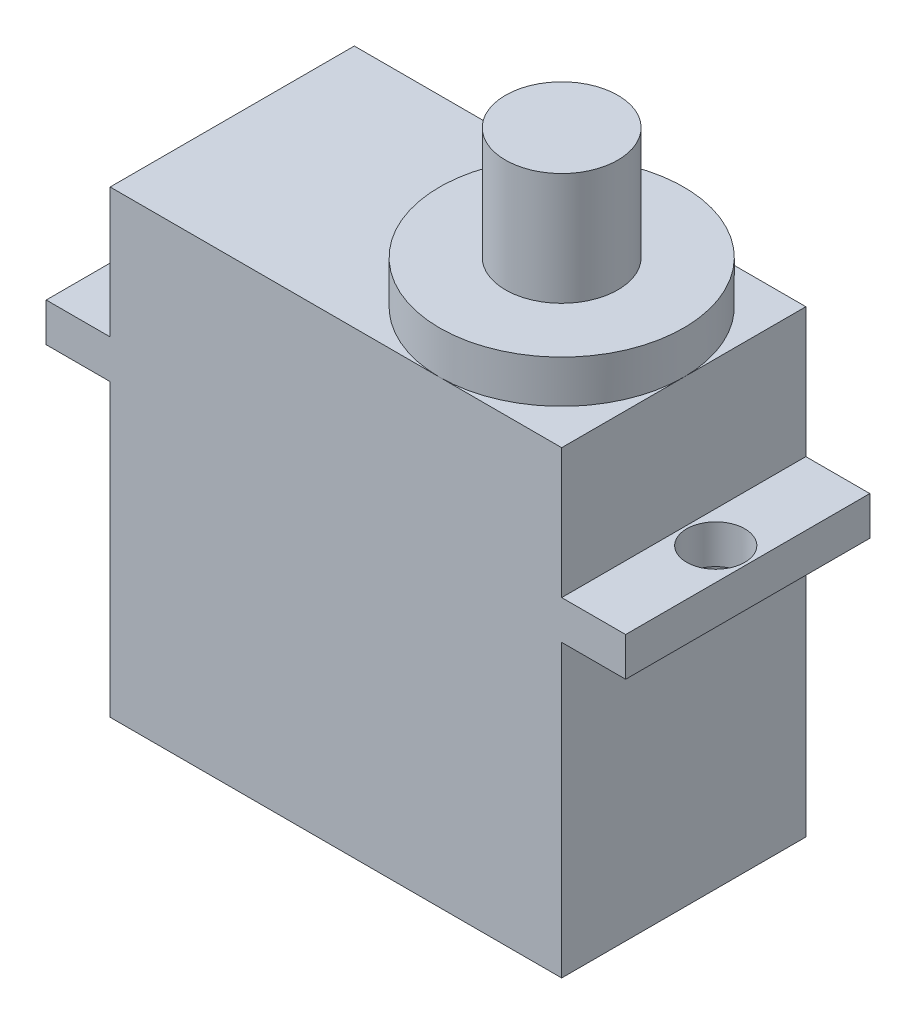
ISO-10303-21;
HEADER;
FILE_DESCRIPTION(('STEP AP214'),'2;1');
FILE_NAME('part.step','',(''),(''),'','','');
FILE_SCHEMA(('AUTOMOTIVE_DESIGN { 1 0 10303 214 1 1 1 1 }'));
ENDSEC;
DATA;
#1=APPLICATION_CONTEXT('core data for automotive mechanical design processes');
#2=APPLICATION_PROTOCOL_DEFINITION('international standard','automotive_design',2000,#1);
#3=PRODUCT_CONTEXT('',#1,'mechanical');
#4=PRODUCT('Part','Part','',(#3));
#5=PRODUCT_RELATED_PRODUCT_CATEGORY('part','',(#4));
#6=PRODUCT_DEFINITION_FORMATION('','',#4);
#7=PRODUCT_DEFINITION_CONTEXT('part definition',#1,'design');
#8=PRODUCT_DEFINITION('design','',#6,#7);
#9=PRODUCT_DEFINITION_SHAPE('','',#8);
#10=(LENGTH_UNIT() NAMED_UNIT(*) SI_UNIT(.MILLI.,.METRE.));
#11=(NAMED_UNIT(*) PLANE_ANGLE_UNIT() SI_UNIT($,.RADIAN.));
#12=(NAMED_UNIT(*) SI_UNIT($,.STERADIAN.) SOLID_ANGLE_UNIT());
#13=UNCERTAINTY_MEASURE_WITH_UNIT(LENGTH_MEASURE(1.E-05),#10,'distance_accuracy_value','');
#14=(GEOMETRIC_REPRESENTATION_CONTEXT(3) GLOBAL_UNCERTAINTY_ASSIGNED_CONTEXT((#13)) GLOBAL_UNIT_ASSIGNED_CONTEXT((#10,
#11,#12)) REPRESENTATION_CONTEXT('',''));
#15=CARTESIAN_POINT('',(0.,0.,0.));
#16=DIRECTION('',(0.,0.,1.));
#17=DIRECTION('',(1.,0.,0.));
#18=AXIS2_PLACEMENT_3D('',#15,#16,#17);
#19=CARTESIAN_POINT('',(-11.65,11.85,6.3));
#20=DIRECTION('',(0.,-1.,0.));
#21=DIRECTION('',(0.,0.,-1.));
#22=AXIS2_PLACEMENT_3D('',#19,#20,#21);
#23=PLANE('',#22);
#24=CARTESIAN_POINT('',(5.34999999999999,11.85,0.));
#25=DIRECTION('',(0.,1.,0.));
#26=DIRECTION('',(0.,0.,1.));
#27=AXIS2_PLACEMENT_3D('',#24,#25,#26);
#28=CIRCLE('',#27,6.3);
#29=CARTESIAN_POINT('',(5.34999999999999,11.85,6.3));
#30=VERTEX_POINT('',#29);
#31=CARTESIAN_POINT('',(11.65,11.85,0.));
#32=VERTEX_POINT('',#31);
#33=EDGE_CURVE('E153',#30,#32,#28,.T.);
#34=ORIENTED_EDGE('',*,*,#33,.F.);
#35=DIRECTION('',(-1.,0.,0.));
#36=VECTOR('',#35,1.);
#37=CARTESIAN_POINT('',(-11.65,11.85,6.3));
#38=LINE('',#37,#36);
#39=CARTESIAN_POINT('',(11.65,11.85,6.3));
#40=VERTEX_POINT('',#39);
#41=EDGE_CURVE('E136',#40,#30,#38,.T.);
#42=ORIENTED_EDGE('',*,*,#41,.F.);
#43=DIRECTION('',(0.,0.,-1.));
#44=VECTOR('',#43,1.);
#45=CARTESIAN_POINT('',(11.65,11.85,6.3));
#46=LINE('',#45,#44);
#47=EDGE_CURVE('E154',#40,#32,#46,.T.);
#48=ORIENTED_EDGE('',*,*,#47,.T.);
#49=EDGE_LOOP('',(#34,#42,#48));
#50=FACE_BOUND('',#49,.T.);
#51=ADVANCED_FACE('F36',(#50),#23,.F.);
#52=CARTESIAN_POINT('',(5.34999999999999,11.85,-6.3));
#53=VERTEX_POINT('',#52);
#54=EDGE_CURVE('E45',#32,#53,#28,.T.);
#55=ORIENTED_EDGE('',*,*,#54,.F.);
#56=CARTESIAN_POINT('',(11.65,11.85,-6.3));
#57=VERTEX_POINT('',#56);
#58=EDGE_CURVE('E160',#32,#57,#46,.T.);
#59=ORIENTED_EDGE('',*,*,#58,.T.);
#60=DIRECTION('',(-1.,0.,0.));
#61=VECTOR('',#60,1.);
#62=CARTESIAN_POINT('',(-11.65,11.85,-6.3));
#63=LINE('',#62,#61);
#64=EDGE_CURVE('E189',#57,#53,#63,.T.);
#65=ORIENTED_EDGE('',*,*,#64,.T.);
#66=EDGE_LOOP('',(#55,#59,#65));
#67=FACE_BOUND('',#66,.T.);
#68=ADVANCED_FACE('F242',(#67),#23,.F.);
#69=CARTESIAN_POINT('',(11.65,5.15,6.3));
#70=DIRECTION('',(-1.,0.,0.));
#71=DIRECTION('',(0.,-1.,0.));
#72=AXIS2_PLACEMENT_3D('',#69,#70,#71);
#73=PLANE('',#72);
#74=DIRECTION('',(0.,1.,0.));
#75=VECTOR('',#74,1.);
#76=CARTESIAN_POINT('',(11.65,5.15,-6.3));
#77=LINE('',#76,#75);
#78=CARTESIAN_POINT('',(11.65,5.15,-6.3));
#79=VERTEX_POINT('',#78);
#80=EDGE_CURVE('E185',#79,#57,#77,.T.);
#81=ORIENTED_EDGE('',*,*,#80,.T.);
#82=ORIENTED_EDGE('',*,*,#58,.F.);
#83=ORIENTED_EDGE('',*,*,#47,.F.);
#84=DIRECTION('',(0.,1.,0.));
#85=VECTOR('',#84,1.);
#86=CARTESIAN_POINT('',(11.65,5.15,6.3));
#87=LINE('',#86,#85);
#88=CARTESIAN_POINT('',(11.65,5.15,6.3));
#89=VERTEX_POINT('',#88);
#90=EDGE_CURVE('E141',#89,#40,#87,.T.);
#91=ORIENTED_EDGE('',*,*,#90,.F.);
#92=DIRECTION('',(0.,0.,-1.));
#93=VECTOR('',#92,1.);
#94=CARTESIAN_POINT('',(11.65,5.15,6.3));
#95=LINE('',#94,#93);
#96=EDGE_CURVE('E184',#89,#79,#95,.T.);
#97=ORIENTED_EDGE('',*,*,#96,.T.);
#98=EDGE_LOOP('',(#81,#82,#83,#91,#97));
#99=FACE_BOUND('',#98,.T.);
#100=ADVANCED_FACE('F38',(#99),#73,.F.);
#101=EDGE_CURVE('E60',#53,#30,#28,.T.);
#102=ORIENTED_EDGE('',*,*,#101,.F.);
#103=CARTESIAN_POINT('',(-11.65,11.85,-6.3));
#104=VERTEX_POINT('',#103);
#105=EDGE_CURVE('E188',#53,#104,#63,.T.);
#106=ORIENTED_EDGE('',*,*,#105,.T.);
#107=DIRECTION('',(0.,0.,-1.));
#108=VECTOR('',#107,1.);
#109=CARTESIAN_POINT('',(-11.65,11.85,6.3));
#110=LINE('',#109,#108);
#111=CARTESIAN_POINT('',(-11.65,11.85,6.3));
#112=VERTEX_POINT('',#111);
#113=EDGE_CURVE('E150',#112,#104,#110,.T.);
#114=ORIENTED_EDGE('',*,*,#113,.F.);
#115=EDGE_CURVE('E138',#30,#112,#38,.T.);
#116=ORIENTED_EDGE('',*,*,#115,.F.);
#117=EDGE_LOOP('',(#102,#106,#114,#116));
#118=FACE_BOUND('',#117,.T.);
#119=ADVANCED_FACE('F148',(#118),#23,.F.);
#120=CARTESIAN_POINT('',(-11.65,5.15,6.3));
#121=DIRECTION('',(1.,0.,0.));
#122=DIRECTION('',(0.,1.,0.));
#123=AXIS2_PLACEMENT_3D('',#120,#121,#122);
#124=PLANE('',#123);
#125=DIRECTION('',(0.,-1.,0.));
#126=VECTOR('',#125,1.);
#127=CARTESIAN_POINT('',(-11.65,5.15,-6.3));
#128=LINE('',#127,#126);
#129=CARTESIAN_POINT('',(-11.65,5.15,-6.3));
#130=VERTEX_POINT('',#129);
#131=EDGE_CURVE('E191',#104,#130,#128,.T.);
#132=ORIENTED_EDGE('',*,*,#131,.T.);
#133=DIRECTION('',(0.,0.,-1.));
#134=VECTOR('',#133,1.);
#135=CARTESIAN_POINT('',(-11.65,5.15,6.3));
#136=LINE('',#135,#134);
#137=CARTESIAN_POINT('',(-11.65,5.15,6.3));
#138=VERTEX_POINT('',#137);
#139=EDGE_CURVE('E236',#138,#130,#136,.T.);
#140=ORIENTED_EDGE('',*,*,#139,.F.);
#141=DIRECTION('',(0.,-1.,0.));
#142=VECTOR('',#141,1.);
#143=CARTESIAN_POINT('',(-11.65,5.15,6.3));
#144=LINE('',#143,#142);
#145=EDGE_CURVE('E146',#112,#138,#144,.T.);
#146=ORIENTED_EDGE('',*,*,#145,.F.);
#147=ORIENTED_EDGE('',*,*,#113,.T.);
#148=EDGE_LOOP('',(#132,#140,#146,#147));
#149=FACE_BOUND('',#148,.T.);
#150=ADVANCED_FACE('F293',(#149),#124,.F.);
#151=CARTESIAN_POINT('',(-11.65,5.15,6.3));
#152=DIRECTION('',(0.,-1.,0.));
#153=DIRECTION('',(0.,0.,-1.));
#154=AXIS2_PLACEMENT_3D('',#151,#152,#153);
#155=PLANE('',#154);
#156=CARTESIAN_POINT('',(-13.3,5.15,0.));
#157=DIRECTION('',(0.,1.,0.));
#158=DIRECTION('',(0.,0.,1.));
#159=AXIS2_PLACEMENT_3D('',#156,#157,#158);
#160=CIRCLE('',#159,1.5);
#161=CARTESIAN_POINT('',(-13.3,5.15,1.5));
#162=VERTEX_POINT('',#161);
#163=EDGE_CURVE('E482',#162,#162,#160,.T.);
#164=ORIENTED_EDGE('',*,*,#163,.F.);
#165=EDGE_LOOP('',(#164));
#166=FACE_BOUND('',#165,.T.);
#167=DIRECTION('',(-1.,0.,0.));
#168=VECTOR('',#167,1.);
#169=CARTESIAN_POINT('',(-11.65,5.15,-6.3));
#170=LINE('',#169,#168);
#171=CARTESIAN_POINT('',(-14.95,5.15,-6.3));
#172=VERTEX_POINT('',#171);
#173=EDGE_CURVE('E193',#130,#172,#170,.T.);
#174=ORIENTED_EDGE('',*,*,#173,.T.);
#175=DIRECTION('',(0.,0.,-1.));
#176=VECTOR('',#175,1.);
#177=CARTESIAN_POINT('',(-14.95,5.15,6.3));
#178=LINE('',#177,#176);
#179=CARTESIAN_POINT('',(-14.95,5.15,6.3));
#180=VERTEX_POINT('',#179);
#181=EDGE_CURVE('E233',#180,#172,#178,.T.);
#182=ORIENTED_EDGE('',*,*,#181,.F.);
#183=DIRECTION('',(-1.,0.,0.));
#184=VECTOR('',#183,1.);
#185=CARTESIAN_POINT('',(-11.65,5.15,6.3));
#186=LINE('',#185,#184);
#187=EDGE_CURVE('E166',#138,#180,#186,.T.);
#188=ORIENTED_EDGE('',*,*,#187,.F.);
#189=ORIENTED_EDGE('',*,*,#139,.T.);
#190=EDGE_LOOP('',(#174,#182,#188,#189));
#191=FACE_BOUND('',#190,.T.);
#192=ADVANCED_FACE('F291',(#166,#191),#155,.F.);
#193=CARTESIAN_POINT('',(-14.95,5.15,6.3));
#194=DIRECTION('',(1.,0.,0.));
#195=DIRECTION('',(0.,0.,-1.));
#196=AXIS2_PLACEMENT_3D('',#193,#194,#195);
#197=PLANE('',#196);
#198=DIRECTION('',(0.,-1.,0.));
#199=VECTOR('',#198,1.);
#200=CARTESIAN_POINT('',(-14.95,5.15,-6.3));
#201=LINE('',#200,#199);
#202=CARTESIAN_POINT('',(-14.95,3.15,-6.3));
#203=VERTEX_POINT('',#202);
#204=EDGE_CURVE('E195',#172,#203,#201,.T.);
#205=ORIENTED_EDGE('',*,*,#204,.T.);
#206=DIRECTION('',(0.,0.,-1.));
#207=VECTOR('',#206,1.);
#208=CARTESIAN_POINT('',(-14.95,3.15,6.3));
#209=LINE('',#208,#207);
#210=CARTESIAN_POINT('',(-14.95,3.15,6.3));
#211=VERTEX_POINT('',#210);
#212=EDGE_CURVE('E230',#211,#203,#209,.T.);
#213=ORIENTED_EDGE('',*,*,#212,.F.);
#214=DIRECTION('',(0.,-1.,0.));
#215=VECTOR('',#214,1.);
#216=CARTESIAN_POINT('',(-14.95,5.15,6.3));
#217=LINE('',#216,#215);
#218=EDGE_CURVE('E168',#180,#211,#217,.T.);
#219=ORIENTED_EDGE('',*,*,#218,.F.);
#220=ORIENTED_EDGE('',*,*,#181,.T.);
#221=EDGE_LOOP('',(#205,#213,#219,#220));
#222=FACE_BOUND('',#221,.T.);
#223=ADVANCED_FACE('F286',(#222),#197,.F.);
#224=CARTESIAN_POINT('',(-14.95,3.15,6.3));
#225=DIRECTION('',(0.,1.,0.));
#226=DIRECTION('',(-1.,0.,0.));
#227=AXIS2_PLACEMENT_3D('',#224,#225,#226);
#228=PLANE('',#227);
#229=CARTESIAN_POINT('',(-13.3,3.15,0.));
#230=DIRECTION('',(0.,1.,0.));
#231=DIRECTION('',(-1.,0.,0.));
#232=AXIS2_PLACEMENT_3D('',#229,#230,#231);
#233=CIRCLE('',#232,1.5);
#234=CARTESIAN_POINT('',(-14.8,3.15,0.));
#235=VERTEX_POINT('',#234);
#236=EDGE_CURVE('E40',#235,#235,#233,.T.);
#237=ORIENTED_EDGE('',*,*,#236,.T.);
#238=EDGE_LOOP('',(#237));
#239=FACE_BOUND('',#238,.T.);
#240=DIRECTION('',(1.,0.,0.));
#241=VECTOR('',#240,1.);
#242=CARTESIAN_POINT('',(-14.95,3.15,-6.3));
#243=LINE('',#242,#241);
#244=CARTESIAN_POINT('',(-11.65,3.15,-6.3));
#245=VERTEX_POINT('',#244);
#246=EDGE_CURVE('E197',#203,#245,#243,.T.);
#247=ORIENTED_EDGE('',*,*,#246,.T.);
#248=DIRECTION('',(0.,0.,-1.));
#249=VECTOR('',#248,1.);
#250=CARTESIAN_POINT('',(-11.65,3.15,6.3));
#251=LINE('',#250,#249);
#252=CARTESIAN_POINT('',(-11.65,3.15,6.3));
#253=VERTEX_POINT('',#252);
#254=EDGE_CURVE('E227',#253,#245,#251,.T.);
#255=ORIENTED_EDGE('',*,*,#254,.F.);
#256=DIRECTION('',(1.,0.,0.));
#257=VECTOR('',#256,1.);
#258=CARTESIAN_POINT('',(-14.95,3.15,6.3));
#259=LINE('',#258,#257);
#260=EDGE_CURVE('E170',#211,#253,#259,.T.);
#261=ORIENTED_EDGE('',*,*,#260,.F.);
#262=ORIENTED_EDGE('',*,*,#212,.T.);
#263=EDGE_LOOP('',(#247,#255,#261,#262));
#264=FACE_BOUND('',#263,.T.);
#265=ADVANCED_FACE('F281',(#239,#264),#228,.F.);
#266=CARTESIAN_POINT('',(-11.65,-11.85,6.3));
#267=DIRECTION('',(1.,0.,0.));
#268=DIRECTION('',(0.,1.,0.));
#269=AXIS2_PLACEMENT_3D('',#266,#267,#268);
#270=PLANE('',#269);
#271=DIRECTION('',(0.,-1.,0.));
#272=VECTOR('',#271,1.);
#273=CARTESIAN_POINT('',(-11.65,-11.85,-6.3));
#274=LINE('',#273,#272);
#275=CARTESIAN_POINT('',(-11.65,-11.85,-6.3));
#276=VERTEX_POINT('',#275);
#277=EDGE_CURVE('E199',#245,#276,#274,.T.);
#278=ORIENTED_EDGE('',*,*,#277,.T.);
#279=DIRECTION('',(0.,0.,-1.));
#280=VECTOR('',#279,1.);
#281=CARTESIAN_POINT('',(-11.65,-11.85,6.3));
#282=LINE('',#281,#280);
#283=CARTESIAN_POINT('',(-11.65,-11.85,6.3));
#284=VERTEX_POINT('',#283);
#285=EDGE_CURVE('E224',#284,#276,#282,.T.);
#286=ORIENTED_EDGE('',*,*,#285,.F.);
#287=DIRECTION('',(0.,-1.,0.));
#288=VECTOR('',#287,1.);
#289=CARTESIAN_POINT('',(-11.65,-11.85,6.3));
#290=LINE('',#289,#288);
#291=EDGE_CURVE('E172',#253,#284,#290,.T.);
#292=ORIENTED_EDGE('',*,*,#291,.F.);
#293=ORIENTED_EDGE('',*,*,#254,.T.);
#294=EDGE_LOOP('',(#278,#286,#292,#293));
#295=FACE_BOUND('',#294,.T.);
#296=ADVANCED_FACE('F277',(#295),#270,.F.);
#297=CARTESIAN_POINT('',(-11.65,-11.85,6.3));
#298=DIRECTION('',(0.,1.,0.));
#299=DIRECTION('',(0.,0.,1.));
#300=AXIS2_PLACEMENT_3D('',#297,#298,#299);
#301=PLANE('',#300);
#302=DIRECTION('',(1.,0.,0.));
#303=VECTOR('',#302,1.);
#304=CARTESIAN_POINT('',(-11.65,-11.85,-6.3));
#305=LINE('',#304,#303);
#306=CARTESIAN_POINT('',(11.65,-11.85,-6.3));
#307=VERTEX_POINT('',#306);
#308=EDGE_CURVE('E201',#276,#307,#305,.T.);
#309=ORIENTED_EDGE('',*,*,#308,.T.);
#310=DIRECTION('',(0.,0.,-1.));
#311=VECTOR('',#310,1.);
#312=CARTESIAN_POINT('',(11.65,-11.85,6.3));
#313=LINE('',#312,#311);
#314=CARTESIAN_POINT('',(11.65,-11.85,6.3));
#315=VERTEX_POINT('',#314);
#316=EDGE_CURVE('E221',#315,#307,#313,.T.);
#317=ORIENTED_EDGE('',*,*,#316,.F.);
#318=DIRECTION('',(1.,0.,0.));
#319=VECTOR('',#318,1.);
#320=CARTESIAN_POINT('',(-11.65,-11.85,6.3));
#321=LINE('',#320,#319);
#322=EDGE_CURVE('E174',#284,#315,#321,.T.);
#323=ORIENTED_EDGE('',*,*,#322,.F.);
#324=ORIENTED_EDGE('',*,*,#285,.T.);
#325=EDGE_LOOP('',(#309,#317,#323,#324));
#326=FACE_BOUND('',#325,.T.);
#327=ADVANCED_FACE('F272',(#326),#301,.F.);
#328=CARTESIAN_POINT('',(11.65,-11.85,6.3));
#329=DIRECTION('',(-1.,0.,0.));
#330=DIRECTION('',(0.,0.,1.));
#331=AXIS2_PLACEMENT_3D('',#328,#329,#330);
#332=PLANE('',#331);
#333=DIRECTION('',(0.,1.,0.));
#334=VECTOR('',#333,1.);
#335=CARTESIAN_POINT('',(11.65,-11.85,-6.3));
#336=LINE('',#335,#334);
#337=CARTESIAN_POINT('',(11.65,3.15,-6.3));
#338=VERTEX_POINT('',#337);
#339=EDGE_CURVE('E203',#307,#338,#336,.T.);
#340=ORIENTED_EDGE('',*,*,#339,.T.);
#341=DIRECTION('',(0.,0.,-1.));
#342=VECTOR('',#341,1.);
#343=CARTESIAN_POINT('',(11.65,3.15,6.3));
#344=LINE('',#343,#342);
#345=CARTESIAN_POINT('',(11.65,3.15,6.3));
#346=VERTEX_POINT('',#345);
#347=EDGE_CURVE('E218',#346,#338,#344,.T.);
#348=ORIENTED_EDGE('',*,*,#347,.F.);
#349=DIRECTION('',(0.,1.,0.));
#350=VECTOR('',#349,1.);
#351=CARTESIAN_POINT('',(11.65,-11.85,6.3));
#352=LINE('',#351,#350);
#353=EDGE_CURVE('E176',#315,#346,#352,.T.);
#354=ORIENTED_EDGE('',*,*,#353,.F.);
#355=ORIENTED_EDGE('',*,*,#316,.T.);
#356=EDGE_LOOP('',(#340,#348,#354,#355));
#357=FACE_BOUND('',#356,.T.);
#358=ADVANCED_FACE('F266',(#357),#332,.F.);
#359=CARTESIAN_POINT('',(14.95,3.15,6.3));
#360=DIRECTION('',(0.,1.,0.));
#361=DIRECTION('',(-1.,0.,0.));
#362=AXIS2_PLACEMENT_3D('',#359,#360,#361);
#363=PLANE('',#362);
#364=CARTESIAN_POINT('',(13.3,3.15,0.));
#365=DIRECTION('',(0.,1.,0.));
#366=DIRECTION('',(-1.,0.,0.));
#367=AXIS2_PLACEMENT_3D('',#364,#365,#366);
#368=CIRCLE('',#367,1.5);
#369=CARTESIAN_POINT('',(11.8,3.15,0.));
#370=VERTEX_POINT('',#369);
#371=EDGE_CURVE('E485',#370,#370,#368,.T.);
#372=ORIENTED_EDGE('',*,*,#371,.T.);
#373=EDGE_LOOP('',(#372));
#374=FACE_BOUND('',#373,.T.);
#375=DIRECTION('',(1.,0.,0.));
#376=VECTOR('',#375,1.);
#377=CARTESIAN_POINT('',(14.95,3.15,-6.3));
#378=LINE('',#377,#376);
#379=CARTESIAN_POINT('',(14.95,3.15,-6.3));
#380=VERTEX_POINT('',#379);
#381=EDGE_CURVE('E205',#338,#380,#378,.T.);
#382=ORIENTED_EDGE('',*,*,#381,.T.);
#383=DIRECTION('',(0.,0.,-1.));
#384=VECTOR('',#383,1.);
#385=CARTESIAN_POINT('',(14.95,3.15,6.3));
#386=LINE('',#385,#384);
#387=CARTESIAN_POINT('',(14.95,3.15,6.3));
#388=VERTEX_POINT('',#387);
#389=EDGE_CURVE('E215',#388,#380,#386,.T.);
#390=ORIENTED_EDGE('',*,*,#389,.F.);
#391=DIRECTION('',(1.,0.,0.));
#392=VECTOR('',#391,1.);
#393=CARTESIAN_POINT('',(14.95,3.15,6.3));
#394=LINE('',#393,#392);
#395=EDGE_CURVE('E178',#346,#388,#394,.T.);
#396=ORIENTED_EDGE('',*,*,#395,.F.);
#397=ORIENTED_EDGE('',*,*,#347,.T.);
#398=EDGE_LOOP('',(#382,#390,#396,#397));
#399=FACE_BOUND('',#398,.T.);
#400=ADVANCED_FACE('F262',(#374,#399),#363,.F.);
#401=CARTESIAN_POINT('',(14.95,5.15,6.3));
#402=DIRECTION('',(-1.,0.,0.));
#403=DIRECTION('',(0.,0.,1.));
#404=AXIS2_PLACEMENT_3D('',#401,#402,#403);
#405=PLANE('',#404);
#406=DIRECTION('',(0.,1.,0.));
#407=VECTOR('',#406,1.);
#408=CARTESIAN_POINT('',(14.95,5.15,-6.3));
#409=LINE('',#408,#407);
#410=CARTESIAN_POINT('',(14.95,5.15,-6.3));
#411=VERTEX_POINT('',#410);
#412=EDGE_CURVE('E207',#380,#411,#409,.T.);
#413=ORIENTED_EDGE('',*,*,#412,.T.);
#414=DIRECTION('',(0.,0.,-1.));
#415=VECTOR('',#414,1.);
#416=CARTESIAN_POINT('',(14.95,5.15,6.3));
#417=LINE('',#416,#415);
#418=CARTESIAN_POINT('',(14.95,5.15,6.3));
#419=VERTEX_POINT('',#418);
#420=EDGE_CURVE('E212',#419,#411,#417,.T.);
#421=ORIENTED_EDGE('',*,*,#420,.F.);
#422=DIRECTION('',(0.,1.,0.));
#423=VECTOR('',#422,1.);
#424=CARTESIAN_POINT('',(14.95,5.15,6.3));
#425=LINE('',#424,#423);
#426=EDGE_CURVE('E180',#388,#419,#425,.T.);
#427=ORIENTED_EDGE('',*,*,#426,.F.);
#428=ORIENTED_EDGE('',*,*,#389,.T.);
#429=EDGE_LOOP('',(#413,#421,#427,#428));
#430=FACE_BOUND('',#429,.T.);
#431=ADVANCED_FACE('F257',(#430),#405,.F.);
#432=CARTESIAN_POINT('',(11.65,5.15,6.3));
#433=DIRECTION('',(0.,-1.,0.));
#434=DIRECTION('',(0.,0.,-1.));
#435=AXIS2_PLACEMENT_3D('',#432,#433,#434);
#436=PLANE('',#435);
#437=CARTESIAN_POINT('',(13.3,5.15,0.));
#438=DIRECTION('',(0.,1.,0.));
#439=DIRECTION('',(0.,0.,-1.));
#440=AXIS2_PLACEMENT_3D('',#437,#438,#439);
#441=CIRCLE('',#440,1.5);
#442=CARTESIAN_POINT('',(13.3,5.15,-1.5));
#443=VERTEX_POINT('',#442);
#444=EDGE_CURVE('E491',#443,#443,#441,.T.);
#445=ORIENTED_EDGE('',*,*,#444,.F.);
#446=EDGE_LOOP('',(#445));
#447=FACE_BOUND('',#446,.T.);
#448=DIRECTION('',(-1.,0.,0.));
#449=VECTOR('',#448,1.);
#450=CARTESIAN_POINT('',(11.65,5.15,-6.3));
#451=LINE('',#450,#449);
#452=EDGE_CURVE('E163',#411,#79,#451,.T.);
#453=ORIENTED_EDGE('',*,*,#452,.T.);
#454=ORIENTED_EDGE('',*,*,#96,.F.);
#455=DIRECTION('',(-1.,0.,0.));
#456=VECTOR('',#455,1.);
#457=CARTESIAN_POINT('',(11.65,5.15,6.3));
#458=LINE('',#457,#456);
#459=EDGE_CURVE('E182',#419,#89,#458,.T.);
#460=ORIENTED_EDGE('',*,*,#459,.F.);
#461=ORIENTED_EDGE('',*,*,#420,.T.);
#462=EDGE_LOOP('',(#453,#454,#460,#461));
#463=FACE_BOUND('',#462,.T.);
#464=ADVANCED_FACE('F251',(#447,#463),#436,.F.);
#465=CARTESIAN_POINT('',(0.,0.,6.3));
#466=DIRECTION('',(0.,0.,-1.));
#467=DIRECTION('',(-1.,0.,0.));
#468=AXIS2_PLACEMENT_3D('',#465,#466,#467);
#469=PLANE('',#468);
#470=ORIENTED_EDGE('',*,*,#90,.T.);
#471=ORIENTED_EDGE('',*,*,#41,.T.);
#472=ORIENTED_EDGE('',*,*,#115,.T.);
#473=ORIENTED_EDGE('',*,*,#145,.T.);
#474=ORIENTED_EDGE('',*,*,#187,.T.);
#475=ORIENTED_EDGE('',*,*,#218,.T.);
#476=ORIENTED_EDGE('',*,*,#260,.T.);
#477=ORIENTED_EDGE('',*,*,#291,.T.);
#478=ORIENTED_EDGE('',*,*,#322,.T.);
#479=ORIENTED_EDGE('',*,*,#353,.T.);
#480=ORIENTED_EDGE('',*,*,#395,.T.);
#481=ORIENTED_EDGE('',*,*,#426,.T.);
#482=ORIENTED_EDGE('',*,*,#459,.T.);
#483=EDGE_LOOP('',(#470,#471,#472,#473,#474,#475,#476,#477,#478,#479,#480,#481,#482));
#484=FACE_BOUND('',#483,.T.);
#485=ADVANCED_FACE('F137',(#484),#469,.F.);
#486=CARTESIAN_POINT('',(0.,0.,-6.3));
#487=DIRECTION('',(0.,0.,-1.));
#488=DIRECTION('',(-1.,0.,0.));
#489=AXIS2_PLACEMENT_3D('',#486,#487,#488);
#490=PLANE('',#489);
#491=ORIENTED_EDGE('',*,*,#80,.F.);
#492=ORIENTED_EDGE('',*,*,#452,.F.);
#493=ORIENTED_EDGE('',*,*,#412,.F.);
#494=ORIENTED_EDGE('',*,*,#381,.F.);
#495=ORIENTED_EDGE('',*,*,#339,.F.);
#496=ORIENTED_EDGE('',*,*,#308,.F.);
#497=ORIENTED_EDGE('',*,*,#277,.F.);
#498=ORIENTED_EDGE('',*,*,#246,.F.);
#499=ORIENTED_EDGE('',*,*,#204,.F.);
#500=ORIENTED_EDGE('',*,*,#173,.F.);
#501=ORIENTED_EDGE('',*,*,#131,.F.);
#502=ORIENTED_EDGE('',*,*,#105,.F.);
#503=ORIENTED_EDGE('',*,*,#64,.F.);
#504=EDGE_LOOP('',(#491,#492,#493,#494,#495,#496,#497,#498,#499,#500,#501,#502,#503));
#505=FACE_BOUND('',#504,.T.);
#506=ADVANCED_FACE('F246',(#505),#490,.T.);
#507=CARTESIAN_POINT('',(5.34999999999999,14.05,0.));
#508=DIRECTION('',(0.,-1.,0.));
#509=DIRECTION('',(0.,0.,-1.));
#510=AXIS2_PLACEMENT_3D('',#507,#508,#509);
#511=CYLINDRICAL_SURFACE('',#510,6.3);
#512=CARTESIAN_POINT('',(5.34999999999999,14.05,0.));
#513=DIRECTION('',(0.,1.,0.));
#514=DIRECTION('',(0.,0.,1.));
#515=AXIS2_PLACEMENT_3D('',#512,#513,#514);
#516=CIRCLE('',#515,6.3);
#517=CARTESIAN_POINT('',(5.34999999999999,14.05,6.3));
#518=VERTEX_POINT('',#517);
#519=EDGE_CURVE('E156',#518,#518,#516,.T.);
#520=ORIENTED_EDGE('',*,*,#519,.F.);
#521=EDGE_LOOP('',(#520));
#522=FACE_BOUND('',#521,.T.);
#523=ORIENTED_EDGE('',*,*,#33,.T.);
#524=ORIENTED_EDGE('',*,*,#54,.T.);
#525=ORIENTED_EDGE('',*,*,#101,.T.);
#526=EDGE_LOOP('',(#523,#524,#525));
#527=FACE_BOUND('',#526,.T.);
#528=ADVANCED_FACE('F159',(#522,#527),#511,.T.);
#529=CARTESIAN_POINT('',(0.,14.05,0.));
#530=DIRECTION('',(0.,1.,0.));
#531=DIRECTION('',(0.,0.,1.));
#532=AXIS2_PLACEMENT_3D('',#529,#530,#531);
#533=PLANE('',#532);
#534=CARTESIAN_POINT('',(5.34999999999999,14.05,0.));
#535=DIRECTION('',(0.,1.,0.));
#536=DIRECTION('',(-1.,0.,0.));
#537=AXIS2_PLACEMENT_3D('',#534,#535,#536);
#538=CIRCLE('',#537,2.9);
#539=CARTESIAN_POINT('',(2.44999999999999,14.05,0.));
#540=VERTEX_POINT('',#539);
#541=EDGE_CURVE('E11',#540,#540,#538,.T.);
#542=ORIENTED_EDGE('',*,*,#541,.F.);
#543=EDGE_LOOP('',(#542));
#544=FACE_BOUND('',#543,.T.);
#545=ORIENTED_EDGE('',*,*,#519,.T.);
#546=EDGE_LOOP('',(#545));
#547=FACE_BOUND('',#546,.T.);
#548=ADVANCED_FACE('F344',(#544,#547),#533,.T.);
#549=CARTESIAN_POINT('',(5.34999999999999,19.85,0.));
#550=DIRECTION('',(0.,-1.,0.));
#551=DIRECTION('',(0.,0.,-1.));
#552=AXIS2_PLACEMENT_3D('',#549,#550,#551);
#553=CYLINDRICAL_SURFACE('',#552,2.9);
#554=CARTESIAN_POINT('',(5.34999999999999,19.85,0.));
#555=DIRECTION('',(0.,1.,0.));
#556=DIRECTION('',(-1.,0.,0.));
#557=AXIS2_PLACEMENT_3D('',#554,#555,#556);
#558=CIRCLE('',#557,2.9);
#559=CARTESIAN_POINT('',(2.44999999999999,19.85,0.));
#560=VERTEX_POINT('',#559);
#561=EDGE_CURVE('E157',#560,#560,#558,.T.);
#562=ORIENTED_EDGE('',*,*,#561,.F.);
#563=EDGE_LOOP('',(#562));
#564=FACE_BOUND('',#563,.T.);
#565=ORIENTED_EDGE('',*,*,#541,.T.);
#566=EDGE_LOOP('',(#565));
#567=FACE_BOUND('',#566,.T.);
#568=ADVANCED_FACE('F355',(#564,#567),#553,.T.);
#569=CARTESIAN_POINT('',(5.34999999999999,19.85,0.));
#570=DIRECTION('',(0.,1.,0.));
#571=DIRECTION('',(-1.,0.,0.));
#572=AXIS2_PLACEMENT_3D('',#569,#570,#571);
#573=PLANE('',#572);
#574=ORIENTED_EDGE('',*,*,#561,.T.);
#575=EDGE_LOOP('',(#574));
#576=FACE_BOUND('',#575,.T.);
#577=ADVANCED_FACE('F365',(#576),#573,.T.);
#578=CARTESIAN_POINT('',(13.3,-0.649999999999998,0.));
#579=DIRECTION('',(0.,1.,0.));
#580=DIRECTION('',(0.,0.,1.));
#581=AXIS2_PLACEMENT_3D('',#578,#579,#580);
#582=CYLINDRICAL_SURFACE('',#581,1.5);
#583=ORIENTED_EDGE('',*,*,#444,.T.);
#584=EDGE_LOOP('',(#583));
#585=FACE_BOUND('',#584,.T.);
#586=ORIENTED_EDGE('',*,*,#371,.F.);
#587=EDGE_LOOP('',(#586));
#588=FACE_BOUND('',#587,.T.);
#589=ADVANCED_FACE('F375',(#585,#588),#582,.F.);
#590=CARTESIAN_POINT('',(-13.3,-0.649999999999998,0.));
#591=DIRECTION('',(0.,1.,0.));
#592=DIRECTION('',(0.,0.,1.));
#593=AXIS2_PLACEMENT_3D('',#590,#591,#592);
#594=CYLINDRICAL_SURFACE('',#593,1.5);
#595=ORIENTED_EDGE('',*,*,#163,.T.);
#596=EDGE_LOOP('',(#595));
#597=FACE_BOUND('',#596,.T.);
#598=ORIENTED_EDGE('',*,*,#236,.F.);
#599=EDGE_LOOP('',(#598));
#600=FACE_BOUND('',#599,.T.);
#601=ADVANCED_FACE('F424',(#597,#600),#594,.F.);
#602=CLOSED_SHELL('',(#51,#68,#100,#119,#150,#192,#223,#265,#296,#327,#358,#400,#431,#464,#485,
#506,#528,#548,#568,#577,#589,#601));
#603=MANIFOLD_SOLID_BREP('B2',#602);
#604=ADVANCED_BREP_SHAPE_REPRESENTATION('',(#18,#603),#14);
#605=SHAPE_DEFINITION_REPRESENTATION(#9,#604);
ENDSEC;
END-ISO-10303-21;
